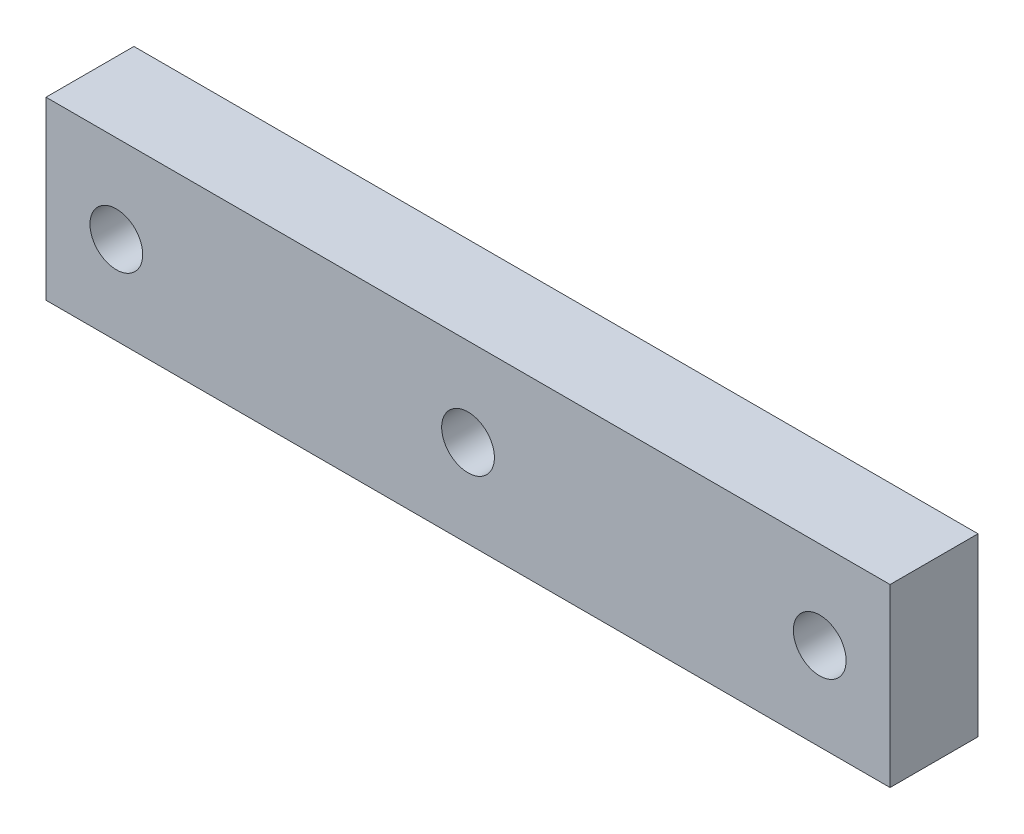
ISO-10303-21;
HEADER;
FILE_DESCRIPTION(('STEP AP214'),'2;1');
FILE_NAME('part.step','',(''),(''),'','','');
FILE_SCHEMA(('AUTOMOTIVE_DESIGN { 1 0 10303 214 1 1 1 1 }'));
ENDSEC;
DATA;
#1=APPLICATION_CONTEXT('core data for automotive mechanical design processes');
#2=APPLICATION_PROTOCOL_DEFINITION('international standard','automotive_design',2000,#1);
#3=PRODUCT_CONTEXT('',#1,'mechanical');
#4=PRODUCT('Part','Part','',(#3));
#5=PRODUCT_RELATED_PRODUCT_CATEGORY('part','',(#4));
#6=PRODUCT_DEFINITION_FORMATION('','',#4);
#7=PRODUCT_DEFINITION_CONTEXT('part definition',#1,'design');
#8=PRODUCT_DEFINITION('design','',#6,#7);
#9=PRODUCT_DEFINITION_SHAPE('','',#8);
#10=(LENGTH_UNIT() NAMED_UNIT(*) SI_UNIT(.MILLI.,.METRE.));
#11=(NAMED_UNIT(*) PLANE_ANGLE_UNIT() SI_UNIT($,.RADIAN.));
#12=(NAMED_UNIT(*) SI_UNIT($,.STERADIAN.) SOLID_ANGLE_UNIT());
#13=UNCERTAINTY_MEASURE_WITH_UNIT(LENGTH_MEASURE(1.E-05),#10,'distance_accuracy_value','');
#14=(GEOMETRIC_REPRESENTATION_CONTEXT(3) GLOBAL_UNCERTAINTY_ASSIGNED_CONTEXT((#13)) GLOBAL_UNIT_ASSIGNED_CONTEXT((#10,
#11,#12)) REPRESENTATION_CONTEXT('',''));
#15=CARTESIAN_POINT('',(0.,0.,0.));
#16=DIRECTION('',(0.,0.,1.));
#17=DIRECTION('',(1.,0.,0.));
#18=AXIS2_PLACEMENT_3D('',#15,#16,#17);
#19=CARTESIAN_POINT('',(0.,0.,35.));
#20=DIRECTION('',(0.,0.,-1.));
#21=DIRECTION('',(-1.,0.,0.));
#22=AXIS2_PLACEMENT_3D('',#19,#20,#21);
#23=PLANE('',#22);
#24=DIRECTION('',(0.,-1.,0.));
#25=VECTOR('',#24,1.);
#26=CARTESIAN_POINT('',(0.,0.,35.));
#27=LINE('',#26,#25);
#28=CARTESIAN_POINT('',(0.,70.,35.));
#29=VERTEX_POINT('',#28);
#30=CARTESIAN_POINT('',(0.,0.,35.));
#31=VERTEX_POINT('',#30);
#32=EDGE_CURVE('E92',#29,#31,#27,.T.);
#33=ORIENTED_EDGE('',*,*,#32,.T.);
#34=DIRECTION('',(1.,0.,0.));
#35=VECTOR('',#34,1.);
#36=CARTESIAN_POINT('',(0.,0.,35.));
#37=LINE('',#36,#35);
#38=CARTESIAN_POINT('',(336.,0.,35.));
#39=VERTEX_POINT('',#38);
#40=EDGE_CURVE('E87',#31,#39,#37,.T.);
#41=ORIENTED_EDGE('',*,*,#40,.T.);
#42=DIRECTION('',(0.,1.,0.));
#43=VECTOR('',#42,1.);
#44=CARTESIAN_POINT('',(336.,0.,35.));
#45=LINE('',#44,#43);
#46=CARTESIAN_POINT('',(336.,70.,35.));
#47=VERTEX_POINT('',#46);
#48=EDGE_CURVE('E90',#39,#47,#45,.T.);
#49=ORIENTED_EDGE('',*,*,#48,.T.);
#50=DIRECTION('',(-1.,0.,0.));
#51=VECTOR('',#50,1.);
#52=CARTESIAN_POINT('',(0.,70.,35.));
#53=LINE('',#52,#51);
#54=EDGE_CURVE('E57',#47,#29,#53,.T.);
#55=ORIENTED_EDGE('',*,*,#54,.T.);
#56=EDGE_LOOP('',(#33,#41,#49,#55));
#57=FACE_BOUND('',#56,.T.);
#58=CARTESIAN_POINT('',(308.,35.,35.));
#59=DIRECTION('',(0.,0.,1.));
#60=DIRECTION('',(1.,0.,0.));
#61=AXIS2_PLACEMENT_3D('',#58,#59,#60);
#62=CIRCLE('',#61,10.5);
#63=CARTESIAN_POINT('',(318.5,35.,35.));
#64=VERTEX_POINT('',#63);
#65=EDGE_CURVE('E112',#64,#64,#62,.T.);
#66=ORIENTED_EDGE('',*,*,#65,.F.);
#67=EDGE_LOOP('',(#66));
#68=FACE_BOUND('',#67,.T.);
#69=CARTESIAN_POINT('',(168.,35.,35.));
#70=DIRECTION('',(0.,0.,1.));
#71=DIRECTION('',(1.,0.,0.));
#72=AXIS2_PLACEMENT_3D('',#69,#70,#71);
#73=CIRCLE('',#72,10.5);
#74=CARTESIAN_POINT('',(178.5,35.,35.));
#75=VERTEX_POINT('',#74);
#76=EDGE_CURVE('E134',#75,#75,#73,.T.);
#77=ORIENTED_EDGE('',*,*,#76,.F.);
#78=EDGE_LOOP('',(#77));
#79=FACE_BOUND('',#78,.T.);
#80=CARTESIAN_POINT('',(28.,35.,35.));
#81=DIRECTION('',(0.,0.,1.));
#82=DIRECTION('',(1.,0.,0.));
#83=AXIS2_PLACEMENT_3D('',#80,#81,#82);
#84=CIRCLE('',#83,10.5);
#85=CARTESIAN_POINT('',(38.5,35.,35.));
#86=VERTEX_POINT('',#85);
#87=EDGE_CURVE('E142',#86,#86,#84,.T.);
#88=ORIENTED_EDGE('',*,*,#87,.F.);
#89=EDGE_LOOP('',(#88));
#90=FACE_BOUND('',#89,.T.);
#91=ADVANCED_FACE('F39',(#57,#68,#79,#90),#23,.F.);
#92=CARTESIAN_POINT('',(0.,0.,0.));
#93=DIRECTION('',(0.,0.,-1.));
#94=DIRECTION('',(-1.,0.,0.));
#95=AXIS2_PLACEMENT_3D('',#92,#93,#94);
#96=PLANE('',#95);
#97=CARTESIAN_POINT('',(168.,35.,0.));
#98=DIRECTION('',(0.,0.,1.));
#99=DIRECTION('',(1.,0.,0.));
#100=AXIS2_PLACEMENT_3D('',#97,#98,#99);
#101=CIRCLE('',#100,10.5);
#102=CARTESIAN_POINT('',(178.5,35.,0.));
#103=VERTEX_POINT('',#102);
#104=EDGE_CURVE('E138',#103,#103,#101,.T.);
#105=ORIENTED_EDGE('',*,*,#104,.T.);
#106=EDGE_LOOP('',(#105));
#107=FACE_BOUND('',#106,.T.);
#108=DIRECTION('',(0.,-1.,0.));
#109=VECTOR('',#108,1.);
#110=CARTESIAN_POINT('',(0.,0.,0.));
#111=LINE('',#110,#109);
#112=CARTESIAN_POINT('',(0.,70.,0.));
#113=VERTEX_POINT('',#112);
#114=CARTESIAN_POINT('',(0.,0.,0.));
#115=VERTEX_POINT('',#114);
#116=EDGE_CURVE('E108',#113,#115,#111,.T.);
#117=ORIENTED_EDGE('',*,*,#116,.F.);
#118=DIRECTION('',(-1.,0.,0.));
#119=VECTOR('',#118,1.);
#120=CARTESIAN_POINT('',(0.,70.,0.));
#121=LINE('',#120,#119);
#122=CARTESIAN_POINT('',(336.,70.,0.));
#123=VERTEX_POINT('',#122);
#124=EDGE_CURVE('E80',#123,#113,#121,.T.);
#125=ORIENTED_EDGE('',*,*,#124,.F.);
#126=DIRECTION('',(0.,1.,0.));
#127=VECTOR('',#126,1.);
#128=CARTESIAN_POINT('',(336.,0.,0.));
#129=LINE('',#128,#127);
#130=CARTESIAN_POINT('',(336.,0.,0.));
#131=VERTEX_POINT('',#130);
#132=EDGE_CURVE('E74',#131,#123,#129,.T.);
#133=ORIENTED_EDGE('',*,*,#132,.F.);
#134=DIRECTION('',(1.,0.,0.));
#135=VECTOR('',#134,1.);
#136=CARTESIAN_POINT('',(0.,0.,0.));
#137=LINE('',#136,#135);
#138=EDGE_CURVE('E97',#115,#131,#137,.T.);
#139=ORIENTED_EDGE('',*,*,#138,.F.);
#140=EDGE_LOOP('',(#117,#125,#133,#139));
#141=FACE_BOUND('',#140,.T.);
#142=CARTESIAN_POINT('',(308.,35.,0.));
#143=DIRECTION('',(0.,0.,1.));
#144=DIRECTION('',(1.,0.,0.));
#145=AXIS2_PLACEMENT_3D('',#142,#143,#144);
#146=CIRCLE('',#145,10.5);
#147=CARTESIAN_POINT('',(318.5,35.,0.));
#148=VERTEX_POINT('',#147);
#149=EDGE_CURVE('E130',#148,#148,#146,.T.);
#150=ORIENTED_EDGE('',*,*,#149,.T.);
#151=EDGE_LOOP('',(#150));
#152=FACE_BOUND('',#151,.T.);
#153=CARTESIAN_POINT('',(28.,35.,0.));
#154=DIRECTION('',(0.,0.,1.));
#155=DIRECTION('',(1.,0.,0.));
#156=AXIS2_PLACEMENT_3D('',#153,#154,#155);
#157=CIRCLE('',#156,10.5);
#158=CARTESIAN_POINT('',(38.5,35.,0.));
#159=VERTEX_POINT('',#158);
#160=EDGE_CURVE('E146',#159,#159,#157,.T.);
#161=ORIENTED_EDGE('',*,*,#160,.T.);
#162=EDGE_LOOP('',(#161));
#163=FACE_BOUND('',#162,.T.);
#164=ADVANCED_FACE('F125',(#107,#141,#152,#163),#96,.T.);
#165=CARTESIAN_POINT('',(0.,0.,35.));
#166=DIRECTION('',(1.,0.,0.));
#167=DIRECTION('',(0.,0.,-1.));
#168=AXIS2_PLACEMENT_3D('',#165,#166,#167);
#169=PLANE('',#168);
#170=ORIENTED_EDGE('',*,*,#116,.T.);
#171=DIRECTION('',(0.,0.,-1.));
#172=VECTOR('',#171,1.);
#173=CARTESIAN_POINT('',(0.,0.,35.));
#174=LINE('',#173,#172);
#175=EDGE_CURVE('E11',#31,#115,#174,.T.);
#176=ORIENTED_EDGE('',*,*,#175,.F.);
#177=ORIENTED_EDGE('',*,*,#32,.F.);
#178=DIRECTION('',(0.,0.,-1.));
#179=VECTOR('',#178,1.);
#180=CARTESIAN_POINT('',(0.,70.,35.));
#181=LINE('',#180,#179);
#182=EDGE_CURVE('E104',#29,#113,#181,.T.);
#183=ORIENTED_EDGE('',*,*,#182,.T.);
#184=EDGE_LOOP('',(#170,#176,#177,#183));
#185=FACE_BOUND('',#184,.T.);
#186=ADVANCED_FACE('F41',(#185),#169,.F.);
#187=CARTESIAN_POINT('',(0.,0.,35.));
#188=DIRECTION('',(0.,1.,0.));
#189=DIRECTION('',(0.,0.,1.));
#190=AXIS2_PLACEMENT_3D('',#187,#188,#189);
#191=PLANE('',#190);
#192=ORIENTED_EDGE('',*,*,#138,.T.);
#193=DIRECTION('',(0.,0.,-1.));
#194=VECTOR('',#193,1.);
#195=CARTESIAN_POINT('',(336.,0.,35.));
#196=LINE('',#195,#194);
#197=EDGE_CURVE('E49',#39,#131,#196,.T.);
#198=ORIENTED_EDGE('',*,*,#197,.F.);
#199=ORIENTED_EDGE('',*,*,#40,.F.);
#200=ORIENTED_EDGE('',*,*,#175,.T.);
#201=EDGE_LOOP('',(#192,#198,#199,#200));
#202=FACE_BOUND('',#201,.T.);
#203=ADVANCED_FACE('F96',(#202),#191,.F.);
#204=CARTESIAN_POINT('',(336.,0.,35.));
#205=DIRECTION('',(-1.,0.,0.));
#206=DIRECTION('',(0.,0.,1.));
#207=AXIS2_PLACEMENT_3D('',#204,#205,#206);
#208=PLANE('',#207);
#209=ORIENTED_EDGE('',*,*,#132,.T.);
#210=DIRECTION('',(0.,0.,-1.));
#211=VECTOR('',#210,1.);
#212=CARTESIAN_POINT('',(336.,70.,35.));
#213=LINE('',#212,#211);
#214=EDGE_CURVE('E99',#47,#123,#213,.T.);
#215=ORIENTED_EDGE('',*,*,#214,.F.);
#216=ORIENTED_EDGE('',*,*,#48,.F.);
#217=ORIENTED_EDGE('',*,*,#197,.T.);
#218=EDGE_LOOP('',(#209,#215,#216,#217));
#219=FACE_BOUND('',#218,.T.);
#220=ADVANCED_FACE('F100',(#219),#208,.F.);
#221=CARTESIAN_POINT('',(0.,70.,35.));
#222=DIRECTION('',(0.,-1.,0.));
#223=DIRECTION('',(0.,0.,-1.));
#224=AXIS2_PLACEMENT_3D('',#221,#222,#223);
#225=PLANE('',#224);
#226=ORIENTED_EDGE('',*,*,#124,.T.);
#227=ORIENTED_EDGE('',*,*,#182,.F.);
#228=ORIENTED_EDGE('',*,*,#54,.F.);
#229=ORIENTED_EDGE('',*,*,#214,.T.);
#230=EDGE_LOOP('',(#226,#227,#228,#229));
#231=FACE_BOUND('',#230,.T.);
#232=ADVANCED_FACE('F122',(#231),#225,.F.);
#233=CARTESIAN_POINT('',(308.,35.,35.));
#234=DIRECTION('',(0.,0.,-1.));
#235=DIRECTION('',(-1.,0.,0.));
#236=AXIS2_PLACEMENT_3D('',#233,#234,#235);
#237=CYLINDRICAL_SURFACE('',#236,10.5);
#238=ORIENTED_EDGE('',*,*,#65,.T.);
#239=EDGE_LOOP('',(#238));
#240=FACE_BOUND('',#239,.T.);
#241=ORIENTED_EDGE('',*,*,#149,.F.);
#242=EDGE_LOOP('',(#241));
#243=FACE_BOUND('',#242,.T.);
#244=ADVANCED_FACE('F165',(#240,#243),#237,.F.);
#245=CARTESIAN_POINT('',(168.,35.,35.));
#246=DIRECTION('',(0.,0.,-1.));
#247=DIRECTION('',(-1.,0.,0.));
#248=AXIS2_PLACEMENT_3D('',#245,#246,#247);
#249=CYLINDRICAL_SURFACE('',#248,10.5);
#250=ORIENTED_EDGE('',*,*,#76,.T.);
#251=EDGE_LOOP('',(#250));
#252=FACE_BOUND('',#251,.T.);
#253=ORIENTED_EDGE('',*,*,#104,.F.);
#254=EDGE_LOOP('',(#253));
#255=FACE_BOUND('',#254,.T.);
#256=ADVANCED_FACE('F211',(#252,#255),#249,.F.);
#257=CARTESIAN_POINT('',(28.,35.,35.));
#258=DIRECTION('',(0.,0.,-1.));
#259=DIRECTION('',(-1.,0.,0.));
#260=AXIS2_PLACEMENT_3D('',#257,#258,#259);
#261=CYLINDRICAL_SURFACE('',#260,10.5);
#262=ORIENTED_EDGE('',*,*,#87,.T.);
#263=EDGE_LOOP('',(#262));
#264=FACE_BOUND('',#263,.T.);
#265=ORIENTED_EDGE('',*,*,#160,.F.);
#266=EDGE_LOOP('',(#265));
#267=FACE_BOUND('',#266,.T.);
#268=ADVANCED_FACE('F154',(#264,#267),#261,.F.);
#269=CLOSED_SHELL('',(#91,#164,#186,#203,#220,#232,#244,#256,#268));
#270=MANIFOLD_SOLID_BREP('B2',#269);
#271=ADVANCED_BREP_SHAPE_REPRESENTATION('',(#18,#270),#14);
#272=SHAPE_DEFINITION_REPRESENTATION(#9,#271);
ENDSEC;
END-ISO-10303-21;
